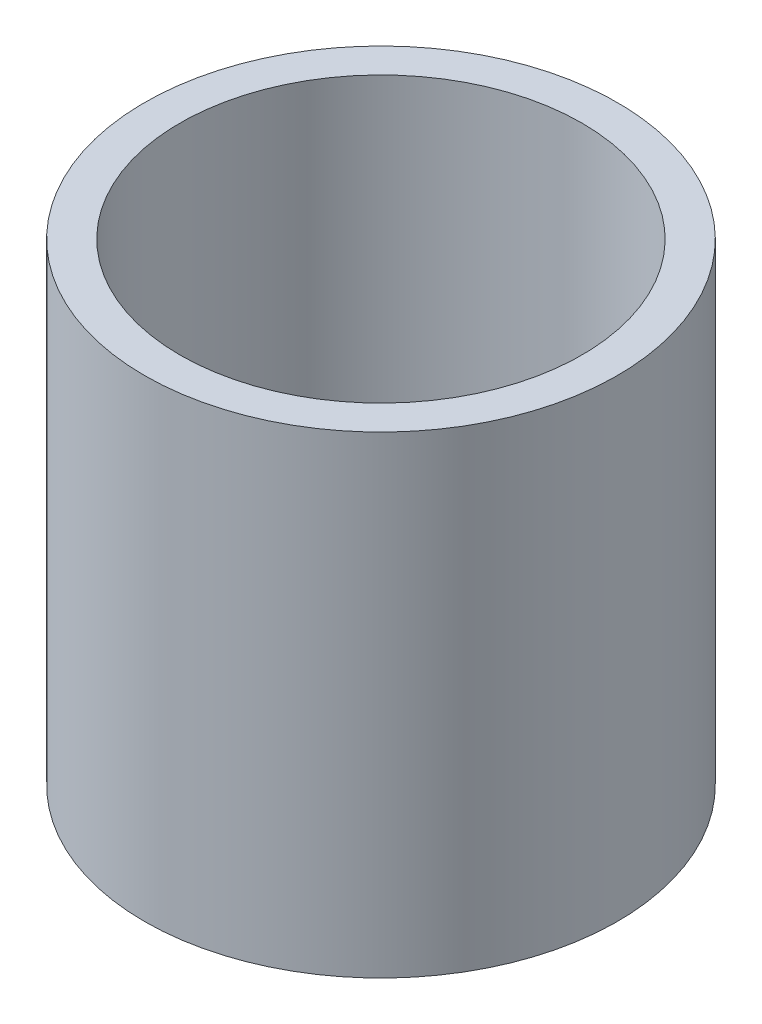
ISO-10303-21;
HEADER;
FILE_DESCRIPTION(('STEP AP214'),'2;1');
FILE_NAME('part.step','',(''),(''),'','','');
FILE_SCHEMA(('AUTOMOTIVE_DESIGN { 1 0 10303 214 1 1 1 1 }'));
ENDSEC;
DATA;
#1=APPLICATION_CONTEXT('core data for automotive mechanical design processes');
#2=APPLICATION_PROTOCOL_DEFINITION('international standard','automotive_design',2000,#1);
#3=PRODUCT_CONTEXT('',#1,'mechanical');
#4=PRODUCT('Part','Part','',(#3));
#5=PRODUCT_RELATED_PRODUCT_CATEGORY('part','',(#4));
#6=PRODUCT_DEFINITION_FORMATION('','',#4);
#7=PRODUCT_DEFINITION_CONTEXT('part definition',#1,'design');
#8=PRODUCT_DEFINITION('design','',#6,#7);
#9=PRODUCT_DEFINITION_SHAPE('','',#8);
#10=(LENGTH_UNIT() NAMED_UNIT(*) SI_UNIT(.MILLI.,.METRE.));
#11=(NAMED_UNIT(*) PLANE_ANGLE_UNIT() SI_UNIT($,.RADIAN.));
#12=(NAMED_UNIT(*) SI_UNIT($,.STERADIAN.) SOLID_ANGLE_UNIT());
#13=UNCERTAINTY_MEASURE_WITH_UNIT(LENGTH_MEASURE(1.E-05),#10,'distance_accuracy_value','');
#14=(GEOMETRIC_REPRESENTATION_CONTEXT(3) GLOBAL_UNCERTAINTY_ASSIGNED_CONTEXT((#13)) GLOBAL_UNIT_ASSIGNED_CONTEXT((#10,
#11,#12)) REPRESENTATION_CONTEXT('',''));
#15=CARTESIAN_POINT('',(0.,0.,0.));
#16=DIRECTION('',(0.,0.,1.));
#17=DIRECTION('',(1.,0.,0.));
#18=AXIS2_PLACEMENT_3D('',#15,#16,#17);
#19=CARTESIAN_POINT('',(0.,0.,0.));
#20=DIRECTION('',(0.,1.,0.));
#21=DIRECTION('',(0.,0.,1.));
#22=AXIS2_PLACEMENT_3D('',#19,#20,#21);
#23=PLANE('',#22);
#24=CARTESIAN_POINT('',(0.,0.,0.));
#25=DIRECTION('',(0.,1.,0.));
#26=DIRECTION('',(0.,0.,1.));
#27=AXIS2_PLACEMENT_3D('',#24,#25,#26);
#28=CIRCLE('',#27,40.);
#29=CARTESIAN_POINT('',(0.,0.,40.));
#30=VERTEX_POINT('',#29);
#31=EDGE_CURVE('E10',#30,#30,#28,.T.);
#32=ORIENTED_EDGE('',*,*,#31,.F.);
#33=EDGE_LOOP('',(#32));
#34=FACE_BOUND('',#33,.T.);
#35=ADVANCED_FACE('F31',(#34),#23,.F.);
#36=CARTESIAN_POINT('',(0.,5.,0.));
#37=DIRECTION('',(0.,1.,0.));
#38=DIRECTION('',(0.,0.,1.));
#39=AXIS2_PLACEMENT_3D('',#36,#37,#38);
#40=CYLINDRICAL_SURFACE('',#39,40.);
#41=CARTESIAN_POINT('',(0.,80.,0.));
#42=DIRECTION('',(0.,1.,0.));
#43=DIRECTION('',(0.,0.,1.));
#44=AXIS2_PLACEMENT_3D('',#41,#42,#43);
#45=CIRCLE('',#44,40.);
#46=CARTESIAN_POINT('',(0.,80.,40.));
#47=VERTEX_POINT('',#46);
#48=EDGE_CURVE('E37',#47,#47,#45,.T.);
#49=ORIENTED_EDGE('',*,*,#48,.F.);
#50=EDGE_LOOP('',(#49));
#51=FACE_BOUND('',#50,.T.);
#52=ORIENTED_EDGE('',*,*,#31,.T.);
#53=EDGE_LOOP('',(#52));
#54=FACE_BOUND('',#53,.T.);
#55=ADVANCED_FACE('F61',(#51,#54),#40,.T.);
#56=CARTESIAN_POINT('',(34.,80.,0.));
#57=DIRECTION('',(0.,-1.,0.));
#58=DIRECTION('',(0.,0.,-1.));
#59=AXIS2_PLACEMENT_3D('',#56,#57,#58);
#60=PLANE('',#59);
#61=CARTESIAN_POINT('',(0.,80.,0.));
#62=DIRECTION('',(0.,1.,0.));
#63=DIRECTION('',(0.,0.,1.));
#64=AXIS2_PLACEMENT_3D('',#61,#62,#63);
#65=CIRCLE('',#64,34.);
#66=CARTESIAN_POINT('',(0.,80.,34.));
#67=VERTEX_POINT('',#66);
#68=EDGE_CURVE('E41',#67,#67,#65,.T.);
#69=ORIENTED_EDGE('',*,*,#68,.F.);
#70=EDGE_LOOP('',(#69));
#71=FACE_BOUND('',#70,.T.);
#72=ORIENTED_EDGE('',*,*,#48,.T.);
#73=EDGE_LOOP('',(#72));
#74=FACE_BOUND('',#73,.T.);
#75=ADVANCED_FACE('F56',(#71,#74),#60,.F.);
#76=CARTESIAN_POINT('',(0.,5.,0.));
#77=DIRECTION('',(0.,1.,0.));
#78=DIRECTION('',(0.,0.,1.));
#79=AXIS2_PLACEMENT_3D('',#76,#77,#78);
#80=CYLINDRICAL_SURFACE('',#79,34.);
#81=CARTESIAN_POINT('',(0.,5.,0.));
#82=DIRECTION('',(0.,1.,0.));
#83=DIRECTION('',(0.,0.,1.));
#84=AXIS2_PLACEMENT_3D('',#81,#82,#83);
#85=CIRCLE('',#84,34.);
#86=CARTESIAN_POINT('',(0.,5.,34.));
#87=VERTEX_POINT('',#86);
#88=EDGE_CURVE('E45',#87,#87,#85,.T.);
#89=ORIENTED_EDGE('',*,*,#88,.F.);
#90=EDGE_LOOP('',(#89));
#91=FACE_BOUND('',#90,.T.);
#92=ORIENTED_EDGE('',*,*,#68,.T.);
#93=EDGE_LOOP('',(#92));
#94=FACE_BOUND('',#93,.T.);
#95=ADVANCED_FACE('F53',(#91,#94),#80,.F.);
#96=CARTESIAN_POINT('',(0.,5.,0.));
#97=DIRECTION('',(0.,-1.,0.));
#98=DIRECTION('',(0.,0.,-1.));
#99=AXIS2_PLACEMENT_3D('',#96,#97,#98);
#100=PLANE('',#99);
#101=ORIENTED_EDGE('',*,*,#88,.T.);
#102=EDGE_LOOP('',(#101));
#103=FACE_BOUND('',#102,.T.);
#104=ADVANCED_FACE('F51',(#103),#100,.F.);
#105=CLOSED_SHELL('',(#35,#55,#75,#95,#104));
#106=MANIFOLD_SOLID_BREP('B2',#105);
#107=ADVANCED_BREP_SHAPE_REPRESENTATION('',(#18,#106),#14);
#108=SHAPE_DEFINITION_REPRESENTATION(#9,#107);
ENDSEC;
END-ISO-10303-21;
